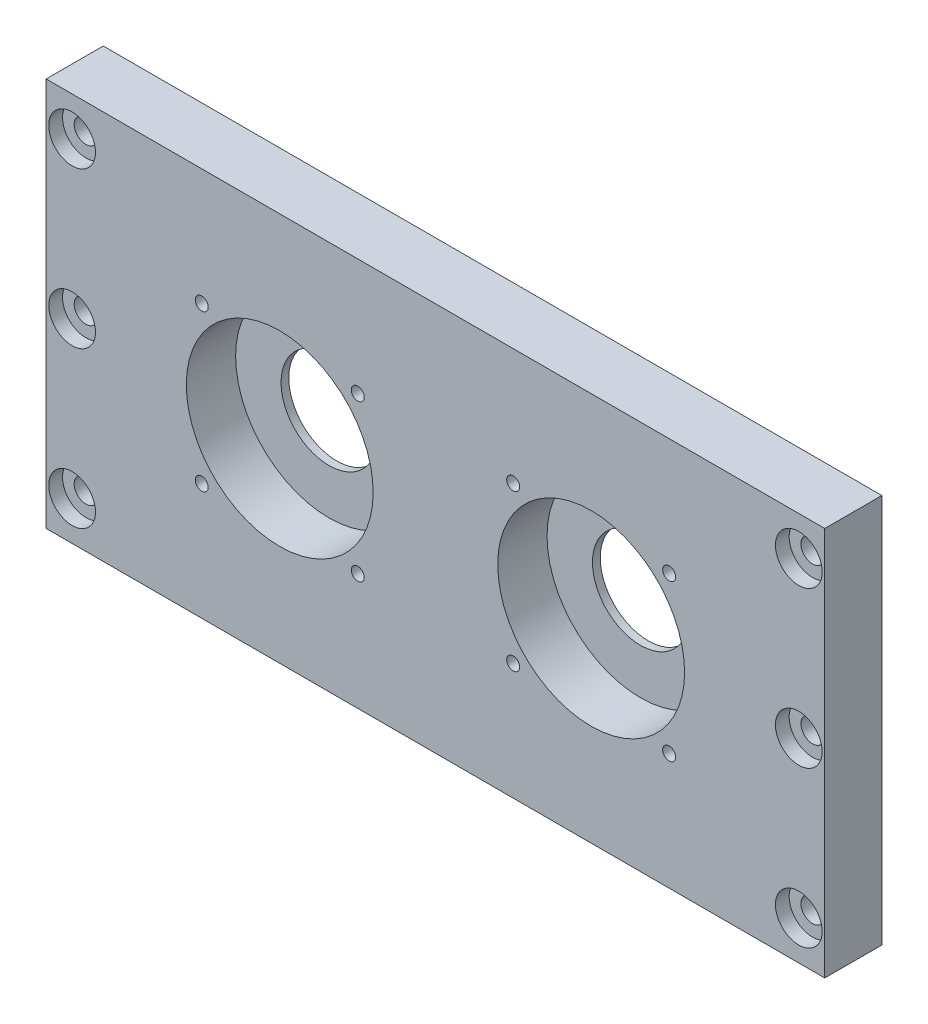
ISO-10303-21;
HEADER;
FILE_DESCRIPTION(('STEP AP214'),'2;1');
FILE_NAME('part.step','',(''),(''),'','','');
FILE_SCHEMA(('AUTOMOTIVE_DESIGN { 1 0 10303 214 1 1 1 1 }'));
ENDSEC;
DATA;
#1=APPLICATION_CONTEXT('core data for automotive mechanical design processes');
#2=APPLICATION_PROTOCOL_DEFINITION('international standard','automotive_design',2000,#1);
#3=PRODUCT_CONTEXT('',#1,'mechanical');
#4=PRODUCT('Part','Part','',(#3));
#5=PRODUCT_RELATED_PRODUCT_CATEGORY('part','',(#4));
#6=PRODUCT_DEFINITION_FORMATION('','',#4);
#7=PRODUCT_DEFINITION_CONTEXT('part definition',#1,'design');
#8=PRODUCT_DEFINITION('design','',#6,#7);
#9=PRODUCT_DEFINITION_SHAPE('','',#8);
#10=(LENGTH_UNIT() NAMED_UNIT(*) SI_UNIT(.MILLI.,.METRE.));
#11=(NAMED_UNIT(*) PLANE_ANGLE_UNIT() SI_UNIT($,.RADIAN.));
#12=(NAMED_UNIT(*) SI_UNIT($,.STERADIAN.) SOLID_ANGLE_UNIT());
#13=UNCERTAINTY_MEASURE_WITH_UNIT(LENGTH_MEASURE(1.E-05),#10,'distance_accuracy_value','');
#14=(GEOMETRIC_REPRESENTATION_CONTEXT(3) GLOBAL_UNCERTAINTY_ASSIGNED_CONTEXT((#13)) GLOBAL_UNIT_ASSIGNED_CONTEXT((#10,
#11,#12)) REPRESENTATION_CONTEXT('',''));
#15=CARTESIAN_POINT('',(0.,0.,0.));
#16=DIRECTION('',(0.,0.,1.));
#17=DIRECTION('',(1.,0.,0.));
#18=AXIS2_PLACEMENT_3D('',#15,#16,#17);
#19=CARTESIAN_POINT('',(0.,0.,0.));
#20=DIRECTION('',(0.,0.,-1.));
#21=DIRECTION('',(-1.,0.,0.));
#22=AXIS2_PLACEMENT_3D('',#19,#20,#21);
#23=PLANE('',#22);
#24=CARTESIAN_POINT('',(29.9479617995716,30.0520382004281,0.));
#25=DIRECTION('',(0.,0.,1.));
#26=DIRECTION('',(1.,0.,0.));
#27=AXIS2_PLACEMENT_3D('',#24,#25,#26);
#28=CIRCLE('',#27,2.5);
#29=CARTESIAN_POINT('',(32.4479617995716,30.0520382004281,0.));
#30=VERTEX_POINT('',#29);
#31=EDGE_CURVE('E230',#30,#30,#28,.T.);
#32=ORIENTED_EDGE('',*,*,#31,.T.);
#33=EDGE_LOOP('',(#32));
#34=FACE_BOUND('',#33,.T.);
#35=CARTESIAN_POINT('',(-90.0520382004278,30.0520382004287,0.));
#36=DIRECTION('',(0.,0.,1.));
#37=DIRECTION('',(1.,0.,0.));
#38=AXIS2_PLACEMENT_3D('',#35,#36,#37);
#39=CIRCLE('',#38,2.5);
#40=CARTESIAN_POINT('',(-87.5520382004278,30.0520382004287,0.));
#41=VERTEX_POINT('',#40);
#42=EDGE_CURVE('E224',#41,#41,#39,.T.);
#43=ORIENTED_EDGE('',*,*,#42,.T.);
#44=EDGE_LOOP('',(#43));
#45=FACE_BOUND('',#44,.T.);
#46=CARTESIAN_POINT('',(-90.0520382004284,-30.0520382004281,0.));
#47=DIRECTION('',(0.,0.,1.));
#48=DIRECTION('',(1.,0.,0.));
#49=AXIS2_PLACEMENT_3D('',#46,#47,#48);
#50=CIRCLE('',#49,2.5);
#51=CARTESIAN_POINT('',(-87.5520382004284,-30.0520382004281,0.));
#52=VERTEX_POINT('',#51);
#53=EDGE_CURVE('E218',#52,#52,#50,.T.);
#54=ORIENTED_EDGE('',*,*,#53,.T.);
#55=EDGE_LOOP('',(#54));
#56=FACE_BOUND('',#55,.T.);
#57=CARTESIAN_POINT('',(-29.947961799572,-30.0520382004285,0.));
#58=DIRECTION('',(0.,0.,1.));
#59=DIRECTION('',(1.,0.,0.));
#60=AXIS2_PLACEMENT_3D('',#57,#58,#59);
#61=CIRCLE('',#60,2.5);
#62=CARTESIAN_POINT('',(-27.447961799572,-30.0520382004285,0.));
#63=VERTEX_POINT('',#62);
#64=EDGE_CURVE('E212',#63,#63,#61,.T.);
#65=ORIENTED_EDGE('',*,*,#64,.T.);
#66=EDGE_LOOP('',(#65));
#67=FACE_BOUND('',#66,.T.);
#68=CARTESIAN_POINT('',(-29.9479617995716,30.0520382004281,0.));
#69=DIRECTION('',(0.,0.,1.));
#70=DIRECTION('',(1.,0.,0.));
#71=AXIS2_PLACEMENT_3D('',#68,#69,#70);
#72=CIRCLE('',#71,2.5);
#73=CARTESIAN_POINT('',(-27.4479617995716,30.0520382004281,0.));
#74=VERTEX_POINT('',#73);
#75=EDGE_CURVE('E206',#74,#74,#72,.T.);
#76=ORIENTED_EDGE('',*,*,#75,.T.);
#77=EDGE_LOOP('',(#76));
#78=FACE_BOUND('',#77,.T.);
#79=CARTESIAN_POINT('',(-140.,-60.,0.));
#80=DIRECTION('',(0.,0.,1.));
#81=DIRECTION('',(1.,0.,0.));
#82=AXIS2_PLACEMENT_3D('',#79,#80,#81);
#83=CIRCLE('',#82,4.5);
#84=CARTESIAN_POINT('',(-135.5,-60.,0.));
#85=VERTEX_POINT('',#84);
#86=EDGE_CURVE('E122',#85,#85,#83,.T.);
#87=ORIENTED_EDGE('',*,*,#86,.T.);
#88=EDGE_LOOP('',(#87));
#89=FACE_BOUND('',#88,.T.);
#90=CARTESIAN_POINT('',(-60.,0.,0.));
#91=DIRECTION('',(0.,0.,-1.));
#92=DIRECTION('',(-1.,0.,0.));
#93=AXIS2_PLACEMENT_3D('',#90,#91,#92);
#94=CIRCLE('',#93,18.5);
#95=CARTESIAN_POINT('',(-78.5,0.,0.));
#96=VERTEX_POINT('',#95);
#97=EDGE_CURVE('E114',#96,#96,#94,.T.);
#98=ORIENTED_EDGE('',*,*,#97,.F.);
#99=EDGE_LOOP('',(#98));
#100=FACE_BOUND('',#99,.T.);
#101=DIRECTION('',(0.,1.,0.));
#102=VECTOR('',#101,1.);
#103=CARTESIAN_POINT('',(150.,-75.,0.));
#104=LINE('',#103,#102);
#105=CARTESIAN_POINT('',(150.,-75.,0.));
#106=VERTEX_POINT('',#105);
#107=CARTESIAN_POINT('',(150.,75.,0.));
#108=VERTEX_POINT('',#107);
#109=EDGE_CURVE('E97',#106,#108,#104,.T.);
#110=ORIENTED_EDGE('',*,*,#109,.F.);
#111=DIRECTION('',(1.,0.,0.));
#112=VECTOR('',#111,1.);
#113=CARTESIAN_POINT('',(-150.,-75.,0.));
#114=LINE('',#113,#112);
#115=CARTESIAN_POINT('',(-150.,-75.,0.));
#116=VERTEX_POINT('',#115);
#117=EDGE_CURVE('E72',#116,#106,#114,.T.);
#118=ORIENTED_EDGE('',*,*,#117,.F.);
#119=DIRECTION('',(0.,-1.,0.));
#120=VECTOR('',#119,1.);
#121=CARTESIAN_POINT('',(-150.,-75.,0.));
#122=LINE('',#121,#120);
#123=CARTESIAN_POINT('',(-150.,75.,0.));
#124=VERTEX_POINT('',#123);
#125=EDGE_CURVE('E66',#124,#116,#122,.T.);
#126=ORIENTED_EDGE('',*,*,#125,.F.);
#127=DIRECTION('',(-1.,0.,0.));
#128=VECTOR('',#127,1.);
#129=CARTESIAN_POINT('',(-150.,75.,0.));
#130=LINE('',#129,#128);
#131=EDGE_CURVE('E89',#108,#124,#130,.T.);
#132=ORIENTED_EDGE('',*,*,#131,.F.);
#133=EDGE_LOOP('',(#110,#118,#126,#132));
#134=FACE_BOUND('',#133,.T.);
#135=CARTESIAN_POINT('',(-140.,0.,0.));
#136=DIRECTION('',(0.,0.,1.));
#137=DIRECTION('',(1.,0.,0.));
#138=AXIS2_PLACEMENT_3D('',#135,#136,#137);
#139=CIRCLE('',#138,4.5);
#140=CARTESIAN_POINT('',(-135.5,0.,0.));
#141=VERTEX_POINT('',#140);
#142=EDGE_CURVE('E134',#141,#141,#139,.T.);
#143=ORIENTED_EDGE('',*,*,#142,.T.);
#144=EDGE_LOOP('',(#143));
#145=FACE_BOUND('',#144,.T.);
#146=CARTESIAN_POINT('',(-140.,60.,0.));
#147=DIRECTION('',(0.,0.,1.));
#148=DIRECTION('',(1.,0.,0.));
#149=AXIS2_PLACEMENT_3D('',#146,#147,#148);
#150=CIRCLE('',#149,4.5);
#151=CARTESIAN_POINT('',(-135.5,60.,0.));
#152=VERTEX_POINT('',#151);
#153=EDGE_CURVE('E146',#152,#152,#150,.T.);
#154=ORIENTED_EDGE('',*,*,#153,.T.);
#155=EDGE_LOOP('',(#154));
#156=FACE_BOUND('',#155,.T.);
#157=CARTESIAN_POINT('',(60.,0.,0.));
#158=DIRECTION('',(0.,0.,-1.));
#159=DIRECTION('',(-1.,0.,0.));
#160=AXIS2_PLACEMENT_3D('',#157,#158,#159);
#161=CIRCLE('',#160,18.5);
#162=CARTESIAN_POINT('',(41.5,0.,0.));
#163=VERTEX_POINT('',#162);
#164=EDGE_CURVE('E162',#163,#163,#161,.T.);
#165=ORIENTED_EDGE('',*,*,#164,.F.);
#166=EDGE_LOOP('',(#165));
#167=FACE_BOUND('',#166,.T.);
#168=CARTESIAN_POINT('',(140.,-60.,0.));
#169=DIRECTION('',(0.,0.,1.));
#170=DIRECTION('',(1.,0.,0.));
#171=AXIS2_PLACEMENT_3D('',#168,#169,#170);
#172=CIRCLE('',#171,4.5);
#173=CARTESIAN_POINT('',(144.5,-60.,0.));
#174=VERTEX_POINT('',#173);
#175=EDGE_CURVE('E170',#174,#174,#172,.T.);
#176=ORIENTED_EDGE('',*,*,#175,.T.);
#177=EDGE_LOOP('',(#176));
#178=FACE_BOUND('',#177,.T.);
#179=CARTESIAN_POINT('',(140.,0.,0.));
#180=DIRECTION('',(0.,0.,1.));
#181=DIRECTION('',(1.,0.,0.));
#182=AXIS2_PLACEMENT_3D('',#179,#180,#181);
#183=CIRCLE('',#182,4.5);
#184=CARTESIAN_POINT('',(144.5,0.,0.));
#185=VERTEX_POINT('',#184);
#186=EDGE_CURVE('E182',#185,#185,#183,.T.);
#187=ORIENTED_EDGE('',*,*,#186,.T.);
#188=EDGE_LOOP('',(#187));
#189=FACE_BOUND('',#188,.T.);
#190=CARTESIAN_POINT('',(140.,60.,0.));
#191=DIRECTION('',(0.,0.,1.));
#192=DIRECTION('',(1.,0.,0.));
#193=AXIS2_PLACEMENT_3D('',#190,#191,#192);
#194=CIRCLE('',#193,4.5);
#195=CARTESIAN_POINT('',(144.5,60.,0.));
#196=VERTEX_POINT('',#195);
#197=EDGE_CURVE('E194',#196,#196,#194,.T.);
#198=ORIENTED_EDGE('',*,*,#197,.T.);
#199=EDGE_LOOP('',(#198));
#200=FACE_BOUND('',#199,.T.);
#201=CARTESIAN_POINT('',(29.947961799572,-30.0520382004285,0.));
#202=DIRECTION('',(0.,0.,1.));
#203=DIRECTION('',(1.,0.,0.));
#204=AXIS2_PLACEMENT_3D('',#201,#202,#203);
#205=CIRCLE('',#204,2.5);
#206=CARTESIAN_POINT('',(32.447961799572,-30.0520382004285,0.));
#207=VERTEX_POINT('',#206);
#208=EDGE_CURVE('E236',#207,#207,#205,.T.);
#209=ORIENTED_EDGE('',*,*,#208,.T.);
#210=EDGE_LOOP('',(#209));
#211=FACE_BOUND('',#210,.T.);
#212=CARTESIAN_POINT('',(90.0520382004284,-30.0520382004281,0.));
#213=DIRECTION('',(0.,0.,1.));
#214=DIRECTION('',(1.,0.,0.));
#215=AXIS2_PLACEMENT_3D('',#212,#213,#214);
#216=CIRCLE('',#215,2.5);
#217=CARTESIAN_POINT('',(92.5520382004284,-30.0520382004281,0.));
#218=VERTEX_POINT('',#217);
#219=EDGE_CURVE('E242',#218,#218,#216,.T.);
#220=ORIENTED_EDGE('',*,*,#219,.T.);
#221=EDGE_LOOP('',(#220));
#222=FACE_BOUND('',#221,.T.);
#223=CARTESIAN_POINT('',(90.0520382004278,30.0520382004287,0.));
#224=DIRECTION('',(0.,0.,1.));
#225=DIRECTION('',(1.,0.,0.));
#226=AXIS2_PLACEMENT_3D('',#223,#224,#225);
#227=CIRCLE('',#226,2.5);
#228=CARTESIAN_POINT('',(92.5520382004278,30.0520382004287,0.));
#229=VERTEX_POINT('',#228);
#230=EDGE_CURVE('E248',#229,#229,#227,.T.);
#231=ORIENTED_EDGE('',*,*,#230,.T.);
#232=EDGE_LOOP('',(#231));
#233=FACE_BOUND('',#232,.T.);
#234=ADVANCED_FACE('F32',(#34,#45,#56,#67,#78,#89,#100,#134,#145,#156,#167,#178,#189,#200,#211,
#222,#233),#23,.T.);
#235=CARTESIAN_POINT('',(0.,0.,22.));
#236=DIRECTION('',(0.,0.,-1.));
#237=DIRECTION('',(-1.,0.,0.));
#238=AXIS2_PLACEMENT_3D('',#235,#236,#237);
#239=PLANE('',#238);
#240=CARTESIAN_POINT('',(90.0520382004284,-30.0520382004281,22.));
#241=DIRECTION('',(0.,0.,1.));
#242=DIRECTION('',(1.,0.,0.));
#243=AXIS2_PLACEMENT_3D('',#240,#241,#242);
#244=CIRCLE('',#243,2.5);
#245=CARTESIAN_POINT('',(92.5520382004284,-30.0520382004281,22.));
#246=VERTEX_POINT('',#245);
#247=EDGE_CURVE('E245',#246,#246,#244,.T.);
#248=ORIENTED_EDGE('',*,*,#247,.F.);
#249=EDGE_LOOP('',(#248));
#250=FACE_BOUND('',#249,.T.);
#251=CARTESIAN_POINT('',(29.947961799572,-30.0520382004285,22.));
#252=DIRECTION('',(0.,0.,1.));
#253=DIRECTION('',(1.,0.,0.));
#254=AXIS2_PLACEMENT_3D('',#251,#252,#253);
#255=CIRCLE('',#254,2.5);
#256=CARTESIAN_POINT('',(32.447961799572,-30.0520382004285,22.));
#257=VERTEX_POINT('',#256);
#258=EDGE_CURVE('E239',#257,#257,#255,.T.);
#259=ORIENTED_EDGE('',*,*,#258,.F.);
#260=EDGE_LOOP('',(#259));
#261=FACE_BOUND('',#260,.T.);
#262=CARTESIAN_POINT('',(29.9479617995716,30.0520382004281,22.));
#263=DIRECTION('',(0.,0.,1.));
#264=DIRECTION('',(1.,0.,0.));
#265=AXIS2_PLACEMENT_3D('',#262,#263,#264);
#266=CIRCLE('',#265,2.5);
#267=CARTESIAN_POINT('',(32.4479617995716,30.0520382004281,22.));
#268=VERTEX_POINT('',#267);
#269=EDGE_CURVE('E233',#268,#268,#266,.T.);
#270=ORIENTED_EDGE('',*,*,#269,.F.);
#271=EDGE_LOOP('',(#270));
#272=FACE_BOUND('',#271,.T.);
#273=CARTESIAN_POINT('',(-90.0520382004278,30.0520382004287,22.));
#274=DIRECTION('',(0.,0.,1.));
#275=DIRECTION('',(1.,0.,0.));
#276=AXIS2_PLACEMENT_3D('',#273,#274,#275);
#277=CIRCLE('',#276,2.5);
#278=CARTESIAN_POINT('',(-87.5520382004278,30.0520382004287,22.));
#279=VERTEX_POINT('',#278);
#280=EDGE_CURVE('E227',#279,#279,#277,.T.);
#281=ORIENTED_EDGE('',*,*,#280,.F.);
#282=EDGE_LOOP('',(#281));
#283=FACE_BOUND('',#282,.T.);
#284=CARTESIAN_POINT('',(-29.947961799572,-30.0520382004285,22.));
#285=DIRECTION('',(0.,0.,1.));
#286=DIRECTION('',(1.,0.,0.));
#287=AXIS2_PLACEMENT_3D('',#284,#285,#286);
#288=CIRCLE('',#287,2.5);
#289=CARTESIAN_POINT('',(-27.447961799572,-30.0520382004285,22.));
#290=VERTEX_POINT('',#289);
#291=EDGE_CURVE('E215',#290,#290,#288,.T.);
#292=ORIENTED_EDGE('',*,*,#291,.F.);
#293=EDGE_LOOP('',(#292));
#294=FACE_BOUND('',#293,.T.);
#295=CARTESIAN_POINT('',(-29.9479617995716,30.0520382004281,22.));
#296=DIRECTION('',(0.,0.,1.));
#297=DIRECTION('',(1.,0.,0.));
#298=AXIS2_PLACEMENT_3D('',#295,#296,#297);
#299=CIRCLE('',#298,2.5);
#300=CARTESIAN_POINT('',(-27.4479617995716,30.0520382004281,22.));
#301=VERTEX_POINT('',#300);
#302=EDGE_CURVE('E209',#301,#301,#299,.T.);
#303=ORIENTED_EDGE('',*,*,#302,.F.);
#304=EDGE_LOOP('',(#303));
#305=FACE_BOUND('',#304,.T.);
#306=CARTESIAN_POINT('',(140.,60.,22.));
#307=DIRECTION('',(0.,0.,1.));
#308=DIRECTION('',(1.,0.,0.));
#309=AXIS2_PLACEMENT_3D('',#306,#307,#308);
#310=CIRCLE('',#309,9.0055);
#311=CARTESIAN_POINT('',(149.0055,60.,22.));
#312=VERTEX_POINT('',#311);
#313=EDGE_CURVE('E203',#312,#312,#310,.T.);
#314=ORIENTED_EDGE('',*,*,#313,.F.);
#315=EDGE_LOOP('',(#314));
#316=FACE_BOUND('',#315,.T.);
#317=CARTESIAN_POINT('',(140.,0.,22.));
#318=DIRECTION('',(0.,0.,1.));
#319=DIRECTION('',(1.,0.,0.));
#320=AXIS2_PLACEMENT_3D('',#317,#318,#319);
#321=CIRCLE('',#320,9.0055);
#322=CARTESIAN_POINT('',(149.0055,0.,22.));
#323=VERTEX_POINT('',#322);
#324=EDGE_CURVE('E191',#323,#323,#321,.T.);
#325=ORIENTED_EDGE('',*,*,#324,.F.);
#326=EDGE_LOOP('',(#325));
#327=FACE_BOUND('',#326,.T.);
#328=CARTESIAN_POINT('',(140.,-60.,22.));
#329=DIRECTION('',(0.,0.,1.));
#330=DIRECTION('',(1.,0.,0.));
#331=AXIS2_PLACEMENT_3D('',#328,#329,#330);
#332=CIRCLE('',#331,9.0055);
#333=CARTESIAN_POINT('',(149.0055,-60.,22.));
#334=VERTEX_POINT('',#333);
#335=EDGE_CURVE('E179',#334,#334,#332,.T.);
#336=ORIENTED_EDGE('',*,*,#335,.F.);
#337=EDGE_LOOP('',(#336));
#338=FACE_BOUND('',#337,.T.);
#339=CARTESIAN_POINT('',(60.,0.,22.));
#340=DIRECTION('',(0.,0.,-1.));
#341=DIRECTION('',(-1.,0.,0.));
#342=AXIS2_PLACEMENT_3D('',#339,#340,#341);
#343=CIRCLE('',#342,36.);
#344=CARTESIAN_POINT('',(24.,0.,22.));
#345=VERTEX_POINT('',#344);
#346=EDGE_CURVE('E159',#345,#345,#343,.T.);
#347=ORIENTED_EDGE('',*,*,#346,.T.);
#348=EDGE_LOOP('',(#347));
#349=FACE_BOUND('',#348,.T.);
#350=CARTESIAN_POINT('',(-140.,60.,22.));
#351=DIRECTION('',(0.,0.,1.));
#352=DIRECTION('',(1.,0.,0.));
#353=AXIS2_PLACEMENT_3D('',#350,#351,#352);
#354=CIRCLE('',#353,9.0055);
#355=CARTESIAN_POINT('',(-130.9945,60.,22.));
#356=VERTEX_POINT('',#355);
#357=EDGE_CURVE('E155',#356,#356,#354,.T.);
#358=ORIENTED_EDGE('',*,*,#357,.F.);
#359=EDGE_LOOP('',(#358));
#360=FACE_BOUND('',#359,.T.);
#361=CARTESIAN_POINT('',(-140.,0.,22.));
#362=DIRECTION('',(0.,0.,1.));
#363=DIRECTION('',(1.,0.,0.));
#364=AXIS2_PLACEMENT_3D('',#361,#362,#363);
#365=CIRCLE('',#364,9.0055);
#366=CARTESIAN_POINT('',(-130.9945,0.,22.));
#367=VERTEX_POINT('',#366);
#368=EDGE_CURVE('E143',#367,#367,#365,.T.);
#369=ORIENTED_EDGE('',*,*,#368,.F.);
#370=EDGE_LOOP('',(#369));
#371=FACE_BOUND('',#370,.T.);
#372=CARTESIAN_POINT('',(-60.,0.,22.));
#373=DIRECTION('',(0.,0.,-1.));
#374=DIRECTION('',(-1.,0.,0.));
#375=AXIS2_PLACEMENT_3D('',#372,#373,#374);
#376=CIRCLE('',#375,36.);
#377=CARTESIAN_POINT('',(-96.,0.,22.));
#378=VERTEX_POINT('',#377);
#379=EDGE_CURVE('E111',#378,#378,#376,.T.);
#380=ORIENTED_EDGE('',*,*,#379,.T.);
#381=EDGE_LOOP('',(#380));
#382=FACE_BOUND('',#381,.T.);
#383=DIRECTION('',(0.,1.,0.));
#384=VECTOR('',#383,1.);
#385=CARTESIAN_POINT('',(150.,-75.,22.));
#386=LINE('',#385,#384);
#387=CARTESIAN_POINT('',(150.,-75.,22.));
#388=VERTEX_POINT('',#387);
#389=CARTESIAN_POINT('',(150.,75.,22.));
#390=VERTEX_POINT('',#389);
#391=EDGE_CURVE('E85',#388,#390,#386,.T.);
#392=ORIENTED_EDGE('',*,*,#391,.T.);
#393=DIRECTION('',(-1.,0.,0.));
#394=VECTOR('',#393,1.);
#395=CARTESIAN_POINT('',(-150.,75.,22.));
#396=LINE('',#395,#394);
#397=CARTESIAN_POINT('',(-150.,75.,22.));
#398=VERTEX_POINT('',#397);
#399=EDGE_CURVE('E79',#390,#398,#396,.T.);
#400=ORIENTED_EDGE('',*,*,#399,.T.);
#401=DIRECTION('',(0.,-1.,0.));
#402=VECTOR('',#401,1.);
#403=CARTESIAN_POINT('',(-150.,-75.,22.));
#404=LINE('',#403,#402);
#405=CARTESIAN_POINT('',(-150.,-75.,22.));
#406=VERTEX_POINT('',#405);
#407=EDGE_CURVE('E83',#398,#406,#404,.T.);
#408=ORIENTED_EDGE('',*,*,#407,.T.);
#409=DIRECTION('',(1.,0.,0.));
#410=VECTOR('',#409,1.);
#411=CARTESIAN_POINT('',(-150.,-75.,22.));
#412=LINE('',#411,#410);
#413=EDGE_CURVE('E49',#406,#388,#412,.T.);
#414=ORIENTED_EDGE('',*,*,#413,.T.);
#415=EDGE_LOOP('',(#392,#400,#408,#414));
#416=FACE_BOUND('',#415,.T.);
#417=CARTESIAN_POINT('',(-140.,-60.,22.));
#418=DIRECTION('',(0.,0.,1.));
#419=DIRECTION('',(1.,0.,0.));
#420=AXIS2_PLACEMENT_3D('',#417,#418,#419);
#421=CIRCLE('',#420,9.0055);
#422=CARTESIAN_POINT('',(-130.9945,-60.,22.));
#423=VERTEX_POINT('',#422);
#424=EDGE_CURVE('E131',#423,#423,#421,.T.);
#425=ORIENTED_EDGE('',*,*,#424,.F.);
#426=EDGE_LOOP('',(#425));
#427=FACE_BOUND('',#426,.T.);
#428=CARTESIAN_POINT('',(-90.0520382004284,-30.0520382004281,22.));
#429=DIRECTION('',(0.,0.,1.));
#430=DIRECTION('',(1.,0.,0.));
#431=AXIS2_PLACEMENT_3D('',#428,#429,#430);
#432=CIRCLE('',#431,2.5);
#433=CARTESIAN_POINT('',(-87.5520382004284,-30.0520382004281,22.));
#434=VERTEX_POINT('',#433);
#435=EDGE_CURVE('E221',#434,#434,#432,.T.);
#436=ORIENTED_EDGE('',*,*,#435,.F.);
#437=EDGE_LOOP('',(#436));
#438=FACE_BOUND('',#437,.T.);
#439=CARTESIAN_POINT('',(90.0520382004278,30.0520382004287,22.));
#440=DIRECTION('',(0.,0.,1.));
#441=DIRECTION('',(1.,0.,0.));
#442=AXIS2_PLACEMENT_3D('',#439,#440,#441);
#443=CIRCLE('',#442,2.5);
#444=CARTESIAN_POINT('',(92.5520382004278,30.0520382004287,22.));
#445=VERTEX_POINT('',#444);
#446=EDGE_CURVE('E251',#445,#445,#443,.T.);
#447=ORIENTED_EDGE('',*,*,#446,.F.);
#448=EDGE_LOOP('',(#447));
#449=FACE_BOUND('',#448,.T.);
#450=ADVANCED_FACE('F80',(#250,#261,#272,#283,#294,#305,#316,#327,#338,#349,#360,#371,#382,#416,
#427,#438,#449),#239,.F.);
#451=CARTESIAN_POINT('',(150.,-75.,22.));
#452=DIRECTION('',(-1.,0.,0.));
#453=DIRECTION('',(0.,0.,1.));
#454=AXIS2_PLACEMENT_3D('',#451,#452,#453);
#455=PLANE('',#454);
#456=ORIENTED_EDGE('',*,*,#109,.T.);
#457=DIRECTION('',(0.,0.,-1.));
#458=VECTOR('',#457,1.);
#459=CARTESIAN_POINT('',(150.,75.,22.));
#460=LINE('',#459,#458);
#461=EDGE_CURVE('E11',#390,#108,#460,.T.);
#462=ORIENTED_EDGE('',*,*,#461,.F.);
#463=ORIENTED_EDGE('',*,*,#391,.F.);
#464=DIRECTION('',(0.,0.,-1.));
#465=VECTOR('',#464,1.);
#466=CARTESIAN_POINT('',(150.,-75.,22.));
#467=LINE('',#466,#465);
#468=EDGE_CURVE('E93',#388,#106,#467,.T.);
#469=ORIENTED_EDGE('',*,*,#468,.T.);
#470=EDGE_LOOP('',(#456,#462,#463,#469));
#471=FACE_BOUND('',#470,.T.);
#472=ADVANCED_FACE('F34',(#471),#455,.F.);
#473=CARTESIAN_POINT('',(-150.,75.,22.));
#474=DIRECTION('',(0.,-1.,0.));
#475=DIRECTION('',(0.,0.,-1.));
#476=AXIS2_PLACEMENT_3D('',#473,#474,#475);
#477=PLANE('',#476);
#478=ORIENTED_EDGE('',*,*,#131,.T.);
#479=DIRECTION('',(0.,0.,-1.));
#480=VECTOR('',#479,1.);
#481=CARTESIAN_POINT('',(-150.,75.,22.));
#482=LINE('',#481,#480);
#483=EDGE_CURVE('E41',#398,#124,#482,.T.);
#484=ORIENTED_EDGE('',*,*,#483,.F.);
#485=ORIENTED_EDGE('',*,*,#399,.F.);
#486=ORIENTED_EDGE('',*,*,#461,.T.);
#487=EDGE_LOOP('',(#478,#484,#485,#486));
#488=FACE_BOUND('',#487,.T.);
#489=ADVANCED_FACE('F88',(#488),#477,.F.);
#490=CARTESIAN_POINT('',(-150.,-75.,22.));
#491=DIRECTION('',(1.,0.,0.));
#492=DIRECTION('',(0.,0.,-1.));
#493=AXIS2_PLACEMENT_3D('',#490,#491,#492);
#494=PLANE('',#493);
#495=ORIENTED_EDGE('',*,*,#125,.T.);
#496=DIRECTION('',(0.,0.,-1.));
#497=VECTOR('',#496,1.);
#498=CARTESIAN_POINT('',(-150.,-75.,22.));
#499=LINE('',#498,#497);
#500=EDGE_CURVE('E90',#406,#116,#499,.T.);
#501=ORIENTED_EDGE('',*,*,#500,.F.);
#502=ORIENTED_EDGE('',*,*,#407,.F.);
#503=ORIENTED_EDGE('',*,*,#483,.T.);
#504=EDGE_LOOP('',(#495,#501,#502,#503));
#505=FACE_BOUND('',#504,.T.);
#506=ADVANCED_FACE('F91',(#505),#494,.F.);
#507=CARTESIAN_POINT('',(-150.,-75.,22.));
#508=DIRECTION('',(0.,1.,0.));
#509=DIRECTION('',(0.,0.,1.));
#510=AXIS2_PLACEMENT_3D('',#507,#508,#509);
#511=PLANE('',#510);
#512=ORIENTED_EDGE('',*,*,#117,.T.);
#513=ORIENTED_EDGE('',*,*,#468,.F.);
#514=ORIENTED_EDGE('',*,*,#413,.F.);
#515=ORIENTED_EDGE('',*,*,#500,.T.);
#516=EDGE_LOOP('',(#512,#513,#514,#515));
#517=FACE_BOUND('',#516,.T.);
#518=ADVANCED_FACE('F105',(#517),#511,.F.);
#519=CARTESIAN_POINT('',(-60.,0.,3.));
#520=DIRECTION('',(0.,0.,1.));
#521=DIRECTION('',(1.,0.,0.));
#522=AXIS2_PLACEMENT_3D('',#519,#520,#521);
#523=CYLINDRICAL_SURFACE('',#522,36.);
#524=CARTESIAN_POINT('',(-60.,0.,3.));
#525=DIRECTION('',(0.,0.,-1.));
#526=DIRECTION('',(-1.,0.,0.));
#527=AXIS2_PLACEMENT_3D('',#524,#525,#526);
#528=CIRCLE('',#527,36.);
#529=CARTESIAN_POINT('',(-96.,0.,3.));
#530=VERTEX_POINT('',#529);
#531=EDGE_CURVE('E100',#530,#530,#528,.T.);
#532=ORIENTED_EDGE('',*,*,#531,.T.);
#533=EDGE_LOOP('',(#532));
#534=FACE_BOUND('',#533,.T.);
#535=ORIENTED_EDGE('',*,*,#379,.F.);
#536=EDGE_LOOP('',(#535));
#537=FACE_BOUND('',#536,.T.);
#538=ADVANCED_FACE('F269',(#534,#537),#523,.F.);
#539=CARTESIAN_POINT('',(-60.,0.,3.));
#540=DIRECTION('',(0.,0.,-1.));
#541=DIRECTION('',(-1.,0.,0.));
#542=AXIS2_PLACEMENT_3D('',#539,#540,#541);
#543=PLANE('',#542);
#544=CARTESIAN_POINT('',(-60.,0.,3.));
#545=DIRECTION('',(0.,0.,-1.));
#546=DIRECTION('',(-1.,0.,0.));
#547=AXIS2_PLACEMENT_3D('',#544,#545,#546);
#548=CIRCLE('',#547,18.5);
#549=CARTESIAN_POINT('',(-78.5,0.,3.));
#550=VERTEX_POINT('',#549);
#551=EDGE_CURVE('E119',#550,#550,#548,.T.);
#552=ORIENTED_EDGE('',*,*,#551,.T.);
#553=EDGE_LOOP('',(#552));
#554=FACE_BOUND('',#553,.T.);
#555=ORIENTED_EDGE('',*,*,#531,.F.);
#556=EDGE_LOOP('',(#555));
#557=FACE_BOUND('',#556,.T.);
#558=ADVANCED_FACE('F294',(#554,#557),#543,.F.);
#559=CARTESIAN_POINT('',(-60.,0.,-0.00100000000000013));
#560=DIRECTION('',(0.,0.,1.));
#561=DIRECTION('',(1.,0.,0.));
#562=AXIS2_PLACEMENT_3D('',#559,#560,#561);
#563=CYLINDRICAL_SURFACE('',#562,18.5);
#564=ORIENTED_EDGE('',*,*,#97,.T.);
#565=EDGE_LOOP('',(#564));
#566=FACE_BOUND('',#565,.T.);
#567=ORIENTED_EDGE('',*,*,#551,.F.);
#568=EDGE_LOOP('',(#567));
#569=FACE_BOUND('',#568,.T.);
#570=ADVANCED_FACE('F301',(#566,#569),#563,.F.);
#571=CARTESIAN_POINT('',(-140.,-60.,22.));
#572=DIRECTION('',(0.,0.,1.));
#573=DIRECTION('',(1.,0.,0.));
#574=AXIS2_PLACEMENT_3D('',#571,#572,#573);
#575=CYLINDRICAL_SURFACE('',#574,4.5);
#576=ORIENTED_EDGE('',*,*,#86,.F.);
#577=EDGE_LOOP('',(#576));
#578=FACE_BOUND('',#577,.T.);
#579=CARTESIAN_POINT('',(-140.,-60.,16.7));
#580=DIRECTION('',(0.,0.,1.));
#581=DIRECTION('',(1.,0.,0.));
#582=AXIS2_PLACEMENT_3D('',#579,#580,#581);
#583=CIRCLE('',#582,4.5);
#584=CARTESIAN_POINT('',(-135.5,-60.,16.7));
#585=VERTEX_POINT('',#584);
#586=EDGE_CURVE('E125',#585,#585,#583,.T.);
#587=ORIENTED_EDGE('',*,*,#586,.T.);
#588=EDGE_LOOP('',(#587));
#589=FACE_BOUND('',#588,.T.);
#590=ADVANCED_FACE('F308',(#578,#589),#575,.F.);
#591=CARTESIAN_POINT('',(-135.5,-60.,16.7));
#592=DIRECTION('',(0.,0.,-1.));
#593=DIRECTION('',(-1.,0.,0.));
#594=AXIS2_PLACEMENT_3D('',#591,#592,#593);
#595=PLANE('',#594);
#596=ORIENTED_EDGE('',*,*,#586,.F.);
#597=EDGE_LOOP('',(#596));
#598=FACE_BOUND('',#597,.T.);
#599=CARTESIAN_POINT('',(-140.,-60.,16.7));
#600=DIRECTION('',(0.,0.,1.));
#601=DIRECTION('',(1.,0.,0.));
#602=AXIS2_PLACEMENT_3D('',#599,#600,#601);
#603=CIRCLE('',#602,9.0055);
#604=CARTESIAN_POINT('',(-130.9945,-60.,16.7));
#605=VERTEX_POINT('',#604);
#606=EDGE_CURVE('E128',#605,#605,#603,.T.);
#607=ORIENTED_EDGE('',*,*,#606,.T.);
#608=EDGE_LOOP('',(#607));
#609=FACE_BOUND('',#608,.T.);
#610=ADVANCED_FACE('F316',(#598,#609),#595,.F.);
#611=CARTESIAN_POINT('',(-140.,-60.,22.));
#612=DIRECTION('',(0.,0.,1.));
#613=DIRECTION('',(1.,0.,0.));
#614=AXIS2_PLACEMENT_3D('',#611,#612,#613);
#615=CYLINDRICAL_SURFACE('',#614,9.0055);
#616=ORIENTED_EDGE('',*,*,#606,.F.);
#617=EDGE_LOOP('',(#616));
#618=FACE_BOUND('',#617,.T.);
#619=ORIENTED_EDGE('',*,*,#424,.T.);
#620=EDGE_LOOP('',(#619));
#621=FACE_BOUND('',#620,.T.);
#622=ADVANCED_FACE('F324',(#618,#621),#615,.F.);
#623=CARTESIAN_POINT('',(-140.,0.,22.));
#624=DIRECTION('',(0.,0.,1.));
#625=DIRECTION('',(1.,0.,0.));
#626=AXIS2_PLACEMENT_3D('',#623,#624,#625);
#627=CYLINDRICAL_SURFACE('',#626,4.5);
#628=ORIENTED_EDGE('',*,*,#142,.F.);
#629=EDGE_LOOP('',(#628));
#630=FACE_BOUND('',#629,.T.);
#631=CARTESIAN_POINT('',(-140.,0.,16.7));
#632=DIRECTION('',(0.,0.,1.));
#633=DIRECTION('',(1.,0.,0.));
#634=AXIS2_PLACEMENT_3D('',#631,#632,#633);
#635=CIRCLE('',#634,4.5);
#636=CARTESIAN_POINT('',(-135.5,0.,16.7));
#637=VERTEX_POINT('',#636);
#638=EDGE_CURVE('E137',#637,#637,#635,.T.);
#639=ORIENTED_EDGE('',*,*,#638,.T.);
#640=EDGE_LOOP('',(#639));
#641=FACE_BOUND('',#640,.T.);
#642=ADVANCED_FACE('F332',(#630,#641),#627,.F.);
#643=CARTESIAN_POINT('',(-135.5,0.,16.7));
#644=DIRECTION('',(0.,0.,-1.));
#645=DIRECTION('',(-1.,0.,0.));
#646=AXIS2_PLACEMENT_3D('',#643,#644,#645);
#647=PLANE('',#646);
#648=ORIENTED_EDGE('',*,*,#638,.F.);
#649=EDGE_LOOP('',(#648));
#650=FACE_BOUND('',#649,.T.);
#651=CARTESIAN_POINT('',(-140.,0.,16.7));
#652=DIRECTION('',(0.,0.,1.));
#653=DIRECTION('',(1.,0.,0.));
#654=AXIS2_PLACEMENT_3D('',#651,#652,#653);
#655=CIRCLE('',#654,9.0055);
#656=CARTESIAN_POINT('',(-130.9945,0.,16.7));
#657=VERTEX_POINT('',#656);
#658=EDGE_CURVE('E140',#657,#657,#655,.T.);
#659=ORIENTED_EDGE('',*,*,#658,.T.);
#660=EDGE_LOOP('',(#659));
#661=FACE_BOUND('',#660,.T.);
#662=ADVANCED_FACE('F340',(#650,#661),#647,.F.);
#663=CARTESIAN_POINT('',(-140.,0.,22.));
#664=DIRECTION('',(0.,0.,1.));
#665=DIRECTION('',(1.,0.,0.));
#666=AXIS2_PLACEMENT_3D('',#663,#664,#665);
#667=CYLINDRICAL_SURFACE('',#666,9.0055);
#668=ORIENTED_EDGE('',*,*,#658,.F.);
#669=EDGE_LOOP('',(#668));
#670=FACE_BOUND('',#669,.T.);
#671=ORIENTED_EDGE('',*,*,#368,.T.);
#672=EDGE_LOOP('',(#671));
#673=FACE_BOUND('',#672,.T.);
#674=ADVANCED_FACE('F348',(#670,#673),#667,.F.);
#675=CARTESIAN_POINT('',(-140.,60.,22.));
#676=DIRECTION('',(0.,0.,1.));
#677=DIRECTION('',(1.,0.,0.));
#678=AXIS2_PLACEMENT_3D('',#675,#676,#677);
#679=CYLINDRICAL_SURFACE('',#678,4.5);
#680=ORIENTED_EDGE('',*,*,#153,.F.);
#681=EDGE_LOOP('',(#680));
#682=FACE_BOUND('',#681,.T.);
#683=CARTESIAN_POINT('',(-140.,60.,16.7));
#684=DIRECTION('',(0.,0.,1.));
#685=DIRECTION('',(1.,0.,0.));
#686=AXIS2_PLACEMENT_3D('',#683,#684,#685);
#687=CIRCLE('',#686,4.5);
#688=CARTESIAN_POINT('',(-135.5,60.,16.7));
#689=VERTEX_POINT('',#688);
#690=EDGE_CURVE('E149',#689,#689,#687,.T.);
#691=ORIENTED_EDGE('',*,*,#690,.T.);
#692=EDGE_LOOP('',(#691));
#693=FACE_BOUND('',#692,.T.);
#694=ADVANCED_FACE('F356',(#682,#693),#679,.F.);
#695=CARTESIAN_POINT('',(-135.5,60.,16.7));
#696=DIRECTION('',(0.,0.,-1.));
#697=DIRECTION('',(-1.,0.,0.));
#698=AXIS2_PLACEMENT_3D('',#695,#696,#697);
#699=PLANE('',#698);
#700=ORIENTED_EDGE('',*,*,#690,.F.);
#701=EDGE_LOOP('',(#700));
#702=FACE_BOUND('',#701,.T.);
#703=CARTESIAN_POINT('',(-140.,60.,16.7));
#704=DIRECTION('',(0.,0.,1.));
#705=DIRECTION('',(1.,0.,0.));
#706=AXIS2_PLACEMENT_3D('',#703,#704,#705);
#707=CIRCLE('',#706,9.0055);
#708=CARTESIAN_POINT('',(-130.9945,60.,16.7));
#709=VERTEX_POINT('',#708);
#710=EDGE_CURVE('E152',#709,#709,#707,.T.);
#711=ORIENTED_EDGE('',*,*,#710,.T.);
#712=EDGE_LOOP('',(#711));
#713=FACE_BOUND('',#712,.T.);
#714=ADVANCED_FACE('F364',(#702,#713),#699,.F.);
#715=CARTESIAN_POINT('',(-140.,60.,22.));
#716=DIRECTION('',(0.,0.,1.));
#717=DIRECTION('',(1.,0.,0.));
#718=AXIS2_PLACEMENT_3D('',#715,#716,#717);
#719=CYLINDRICAL_SURFACE('',#718,9.0055);
#720=ORIENTED_EDGE('',*,*,#710,.F.);
#721=EDGE_LOOP('',(#720));
#722=FACE_BOUND('',#721,.T.);
#723=ORIENTED_EDGE('',*,*,#357,.T.);
#724=EDGE_LOOP('',(#723));
#725=FACE_BOUND('',#724,.T.);
#726=ADVANCED_FACE('F372',(#722,#725),#719,.F.);
#727=CARTESIAN_POINT('',(60.,0.,3.));
#728=DIRECTION('',(0.,0.,1.));
#729=DIRECTION('',(1.,0.,0.));
#730=AXIS2_PLACEMENT_3D('',#727,#728,#729);
#731=CYLINDRICAL_SURFACE('',#730,36.);
#732=CARTESIAN_POINT('',(60.,0.,3.));
#733=DIRECTION('',(0.,0.,-1.));
#734=DIRECTION('',(-1.,0.,0.));
#735=AXIS2_PLACEMENT_3D('',#732,#733,#734);
#736=CIRCLE('',#735,36.);
#737=CARTESIAN_POINT('',(24.,0.,3.));
#738=VERTEX_POINT('',#737);
#739=EDGE_CURVE('E158',#738,#738,#736,.T.);
#740=ORIENTED_EDGE('',*,*,#739,.T.);
#741=EDGE_LOOP('',(#740));
#742=FACE_BOUND('',#741,.T.);
#743=ORIENTED_EDGE('',*,*,#346,.F.);
#744=EDGE_LOOP('',(#743));
#745=FACE_BOUND('',#744,.T.);
#746=ADVANCED_FACE('F380',(#742,#745),#731,.F.);
#747=CARTESIAN_POINT('',(60.,0.,3.));
#748=DIRECTION('',(0.,0.,-1.));
#749=DIRECTION('',(-1.,0.,0.));
#750=AXIS2_PLACEMENT_3D('',#747,#748,#749);
#751=PLANE('',#750);
#752=CARTESIAN_POINT('',(60.,0.,3.));
#753=DIRECTION('',(0.,0.,-1.));
#754=DIRECTION('',(-1.,0.,0.));
#755=AXIS2_PLACEMENT_3D('',#752,#753,#754);
#756=CIRCLE('',#755,18.5);
#757=CARTESIAN_POINT('',(41.5,0.,3.));
#758=VERTEX_POINT('',#757);
#759=EDGE_CURVE('E167',#758,#758,#756,.T.);
#760=ORIENTED_EDGE('',*,*,#759,.T.);
#761=EDGE_LOOP('',(#760));
#762=FACE_BOUND('',#761,.T.);
#763=ORIENTED_EDGE('',*,*,#739,.F.);
#764=EDGE_LOOP('',(#763));
#765=FACE_BOUND('',#764,.T.);
#766=ADVANCED_FACE('F388',(#762,#765),#751,.F.);
#767=CARTESIAN_POINT('',(60.,0.,-0.00100000000000013));
#768=DIRECTION('',(0.,0.,1.));
#769=DIRECTION('',(1.,0.,0.));
#770=AXIS2_PLACEMENT_3D('',#767,#768,#769);
#771=CYLINDRICAL_SURFACE('',#770,18.5);
#772=ORIENTED_EDGE('',*,*,#164,.T.);
#773=EDGE_LOOP('',(#772));
#774=FACE_BOUND('',#773,.T.);
#775=ORIENTED_EDGE('',*,*,#759,.F.);
#776=EDGE_LOOP('',(#775));
#777=FACE_BOUND('',#776,.T.);
#778=ADVANCED_FACE('F396',(#774,#777),#771,.F.);
#779=CARTESIAN_POINT('',(140.,-60.,22.));
#780=DIRECTION('',(0.,0.,1.));
#781=DIRECTION('',(1.,0.,0.));
#782=AXIS2_PLACEMENT_3D('',#779,#780,#781);
#783=CYLINDRICAL_SURFACE('',#782,4.5);
#784=ORIENTED_EDGE('',*,*,#175,.F.);
#785=EDGE_LOOP('',(#784));
#786=FACE_BOUND('',#785,.T.);
#787=CARTESIAN_POINT('',(140.,-60.,16.7));
#788=DIRECTION('',(0.,0.,1.));
#789=DIRECTION('',(1.,0.,0.));
#790=AXIS2_PLACEMENT_3D('',#787,#788,#789);
#791=CIRCLE('',#790,4.5);
#792=CARTESIAN_POINT('',(144.5,-60.,16.7));
#793=VERTEX_POINT('',#792);
#794=EDGE_CURVE('E173',#793,#793,#791,.T.);
#795=ORIENTED_EDGE('',*,*,#794,.T.);
#796=EDGE_LOOP('',(#795));
#797=FACE_BOUND('',#796,.T.);
#798=ADVANCED_FACE('F404',(#786,#797),#783,.F.);
#799=CARTESIAN_POINT('',(144.5,-60.,16.7));
#800=DIRECTION('',(0.,0.,-1.));
#801=DIRECTION('',(-1.,0.,0.));
#802=AXIS2_PLACEMENT_3D('',#799,#800,#801);
#803=PLANE('',#802);
#804=ORIENTED_EDGE('',*,*,#794,.F.);
#805=EDGE_LOOP('',(#804));
#806=FACE_BOUND('',#805,.T.);
#807=CARTESIAN_POINT('',(140.,-60.,16.7));
#808=DIRECTION('',(0.,0.,1.));
#809=DIRECTION('',(1.,0.,0.));
#810=AXIS2_PLACEMENT_3D('',#807,#808,#809);
#811=CIRCLE('',#810,9.0055);
#812=CARTESIAN_POINT('',(149.0055,-60.,16.7));
#813=VERTEX_POINT('',#812);
#814=EDGE_CURVE('E176',#813,#813,#811,.T.);
#815=ORIENTED_EDGE('',*,*,#814,.T.);
#816=EDGE_LOOP('',(#815));
#817=FACE_BOUND('',#816,.T.);
#818=ADVANCED_FACE('F412',(#806,#817),#803,.F.);
#819=CARTESIAN_POINT('',(140.,-60.,22.));
#820=DIRECTION('',(0.,0.,1.));
#821=DIRECTION('',(1.,0.,0.));
#822=AXIS2_PLACEMENT_3D('',#819,#820,#821);
#823=CYLINDRICAL_SURFACE('',#822,9.0055);
#824=ORIENTED_EDGE('',*,*,#814,.F.);
#825=EDGE_LOOP('',(#824));
#826=FACE_BOUND('',#825,.T.);
#827=ORIENTED_EDGE('',*,*,#335,.T.);
#828=EDGE_LOOP('',(#827));
#829=FACE_BOUND('',#828,.T.);
#830=ADVANCED_FACE('F420',(#826,#829),#823,.F.);
#831=CARTESIAN_POINT('',(140.,0.,22.));
#832=DIRECTION('',(0.,0.,1.));
#833=DIRECTION('',(1.,0.,0.));
#834=AXIS2_PLACEMENT_3D('',#831,#832,#833);
#835=CYLINDRICAL_SURFACE('',#834,4.5);
#836=ORIENTED_EDGE('',*,*,#186,.F.);
#837=EDGE_LOOP('',(#836));
#838=FACE_BOUND('',#837,.T.);
#839=CARTESIAN_POINT('',(140.,0.,16.7));
#840=DIRECTION('',(0.,0.,1.));
#841=DIRECTION('',(1.,0.,0.));
#842=AXIS2_PLACEMENT_3D('',#839,#840,#841);
#843=CIRCLE('',#842,4.5);
#844=CARTESIAN_POINT('',(144.5,0.,16.7));
#845=VERTEX_POINT('',#844);
#846=EDGE_CURVE('E185',#845,#845,#843,.T.);
#847=ORIENTED_EDGE('',*,*,#846,.T.);
#848=EDGE_LOOP('',(#847));
#849=FACE_BOUND('',#848,.T.);
#850=ADVANCED_FACE('F428',(#838,#849),#835,.F.);
#851=CARTESIAN_POINT('',(144.5,0.,16.7));
#852=DIRECTION('',(0.,0.,-1.));
#853=DIRECTION('',(-1.,0.,0.));
#854=AXIS2_PLACEMENT_3D('',#851,#852,#853);
#855=PLANE('',#854);
#856=ORIENTED_EDGE('',*,*,#846,.F.);
#857=EDGE_LOOP('',(#856));
#858=FACE_BOUND('',#857,.T.);
#859=CARTESIAN_POINT('',(140.,0.,16.7));
#860=DIRECTION('',(0.,0.,1.));
#861=DIRECTION('',(1.,0.,0.));
#862=AXIS2_PLACEMENT_3D('',#859,#860,#861);
#863=CIRCLE('',#862,9.0055);
#864=CARTESIAN_POINT('',(149.0055,0.,16.7));
#865=VERTEX_POINT('',#864);
#866=EDGE_CURVE('E188',#865,#865,#863,.T.);
#867=ORIENTED_EDGE('',*,*,#866,.T.);
#868=EDGE_LOOP('',(#867));
#869=FACE_BOUND('',#868,.T.);
#870=ADVANCED_FACE('F436',(#858,#869),#855,.F.);
#871=CARTESIAN_POINT('',(140.,0.,22.));
#872=DIRECTION('',(0.,0.,1.));
#873=DIRECTION('',(1.,0.,0.));
#874=AXIS2_PLACEMENT_3D('',#871,#872,#873);
#875=CYLINDRICAL_SURFACE('',#874,9.0055);
#876=ORIENTED_EDGE('',*,*,#866,.F.);
#877=EDGE_LOOP('',(#876));
#878=FACE_BOUND('',#877,.T.);
#879=ORIENTED_EDGE('',*,*,#324,.T.);
#880=EDGE_LOOP('',(#879));
#881=FACE_BOUND('',#880,.T.);
#882=ADVANCED_FACE('F444',(#878,#881),#875,.F.);
#883=CARTESIAN_POINT('',(140.,60.,22.));
#884=DIRECTION('',(0.,0.,1.));
#885=DIRECTION('',(1.,0.,0.));
#886=AXIS2_PLACEMENT_3D('',#883,#884,#885);
#887=CYLINDRICAL_SURFACE('',#886,4.5);
#888=ORIENTED_EDGE('',*,*,#197,.F.);
#889=EDGE_LOOP('',(#888));
#890=FACE_BOUND('',#889,.T.);
#891=CARTESIAN_POINT('',(140.,60.,16.7));
#892=DIRECTION('',(0.,0.,1.));
#893=DIRECTION('',(1.,0.,0.));
#894=AXIS2_PLACEMENT_3D('',#891,#892,#893);
#895=CIRCLE('',#894,4.5);
#896=CARTESIAN_POINT('',(144.5,60.,16.7));
#897=VERTEX_POINT('',#896);
#898=EDGE_CURVE('E197',#897,#897,#895,.T.);
#899=ORIENTED_EDGE('',*,*,#898,.T.);
#900=EDGE_LOOP('',(#899));
#901=FACE_BOUND('',#900,.T.);
#902=ADVANCED_FACE('F452',(#890,#901),#887,.F.);
#903=CARTESIAN_POINT('',(144.5,60.,16.7));
#904=DIRECTION('',(0.,0.,-1.));
#905=DIRECTION('',(-1.,0.,0.));
#906=AXIS2_PLACEMENT_3D('',#903,#904,#905);
#907=PLANE('',#906);
#908=ORIENTED_EDGE('',*,*,#898,.F.);
#909=EDGE_LOOP('',(#908));
#910=FACE_BOUND('',#909,.T.);
#911=CARTESIAN_POINT('',(140.,60.,16.7));
#912=DIRECTION('',(0.,0.,1.));
#913=DIRECTION('',(1.,0.,0.));
#914=AXIS2_PLACEMENT_3D('',#911,#912,#913);
#915=CIRCLE('',#914,9.0055);
#916=CARTESIAN_POINT('',(149.0055,60.,16.7));
#917=VERTEX_POINT('',#916);
#918=EDGE_CURVE('E200',#917,#917,#915,.T.);
#919=ORIENTED_EDGE('',*,*,#918,.T.);
#920=EDGE_LOOP('',(#919));
#921=FACE_BOUND('',#920,.T.);
#922=ADVANCED_FACE('F460',(#910,#921),#907,.F.);
#923=CARTESIAN_POINT('',(140.,60.,22.));
#924=DIRECTION('',(0.,0.,1.));
#925=DIRECTION('',(1.,0.,0.));
#926=AXIS2_PLACEMENT_3D('',#923,#924,#925);
#927=CYLINDRICAL_SURFACE('',#926,9.0055);
#928=ORIENTED_EDGE('',*,*,#918,.F.);
#929=EDGE_LOOP('',(#928));
#930=FACE_BOUND('',#929,.T.);
#931=ORIENTED_EDGE('',*,*,#313,.T.);
#932=EDGE_LOOP('',(#931));
#933=FACE_BOUND('',#932,.T.);
#934=ADVANCED_FACE('F468',(#930,#933),#927,.F.);
#935=CARTESIAN_POINT('',(-29.9479617995716,30.0520382004281,22.));
#936=DIRECTION('',(0.,0.,1.));
#937=DIRECTION('',(1.,0.,0.));
#938=AXIS2_PLACEMENT_3D('',#935,#936,#937);
#939=CYLINDRICAL_SURFACE('',#938,2.5);
#940=ORIENTED_EDGE('',*,*,#75,.F.);
#941=EDGE_LOOP('',(#940));
#942=FACE_BOUND('',#941,.T.);
#943=ORIENTED_EDGE('',*,*,#302,.T.);
#944=EDGE_LOOP('',(#943));
#945=FACE_BOUND('',#944,.T.);
#946=ADVANCED_FACE('F476',(#942,#945),#939,.F.);
#947=CARTESIAN_POINT('',(-29.947961799572,-30.0520382004285,22.));
#948=DIRECTION('',(0.,0.,1.));
#949=DIRECTION('',(1.,0.,0.));
#950=AXIS2_PLACEMENT_3D('',#947,#948,#949);
#951=CYLINDRICAL_SURFACE('',#950,2.5);
#952=ORIENTED_EDGE('',*,*,#64,.F.);
#953=EDGE_LOOP('',(#952));
#954=FACE_BOUND('',#953,.T.);
#955=ORIENTED_EDGE('',*,*,#291,.T.);
#956=EDGE_LOOP('',(#955));
#957=FACE_BOUND('',#956,.T.);
#958=ADVANCED_FACE('F484',(#954,#957),#951,.F.);
#959=CARTESIAN_POINT('',(-90.0520382004284,-30.0520382004281,22.));
#960=DIRECTION('',(0.,0.,1.));
#961=DIRECTION('',(1.,0.,0.));
#962=AXIS2_PLACEMENT_3D('',#959,#960,#961);
#963=CYLINDRICAL_SURFACE('',#962,2.5);
#964=ORIENTED_EDGE('',*,*,#53,.F.);
#965=EDGE_LOOP('',(#964));
#966=FACE_BOUND('',#965,.T.);
#967=ORIENTED_EDGE('',*,*,#435,.T.);
#968=EDGE_LOOP('',(#967));
#969=FACE_BOUND('',#968,.T.);
#970=ADVANCED_FACE('F492',(#966,#969),#963,.F.);
#971=CARTESIAN_POINT('',(-90.0520382004278,30.0520382004287,22.));
#972=DIRECTION('',(0.,0.,1.));
#973=DIRECTION('',(1.,0.,0.));
#974=AXIS2_PLACEMENT_3D('',#971,#972,#973);
#975=CYLINDRICAL_SURFACE('',#974,2.5);
#976=ORIENTED_EDGE('',*,*,#42,.F.);
#977=EDGE_LOOP('',(#976));
#978=FACE_BOUND('',#977,.T.);
#979=ORIENTED_EDGE('',*,*,#280,.T.);
#980=EDGE_LOOP('',(#979));
#981=FACE_BOUND('',#980,.T.);
#982=ADVANCED_FACE('F500',(#978,#981),#975,.F.);
#983=CARTESIAN_POINT('',(29.9479617995716,30.0520382004281,22.));
#984=DIRECTION('',(0.,0.,1.));
#985=DIRECTION('',(1.,0.,0.));
#986=AXIS2_PLACEMENT_3D('',#983,#984,#985);
#987=CYLINDRICAL_SURFACE('',#986,2.5);
#988=ORIENTED_EDGE('',*,*,#31,.F.);
#989=EDGE_LOOP('',(#988));
#990=FACE_BOUND('',#989,.T.);
#991=ORIENTED_EDGE('',*,*,#269,.T.);
#992=EDGE_LOOP('',(#991));
#993=FACE_BOUND('',#992,.T.);
#994=ADVANCED_FACE('F508',(#990,#993),#987,.F.);
#995=CARTESIAN_POINT('',(29.947961799572,-30.0520382004285,22.));
#996=DIRECTION('',(0.,0.,1.));
#997=DIRECTION('',(1.,0.,0.));
#998=AXIS2_PLACEMENT_3D('',#995,#996,#997);
#999=CYLINDRICAL_SURFACE('',#998,2.5);
#1000=ORIENTED_EDGE('',*,*,#208,.F.);
#1001=EDGE_LOOP('',(#1000));
#1002=FACE_BOUND('',#1001,.T.);
#1003=ORIENTED_EDGE('',*,*,#258,.T.);
#1004=EDGE_LOOP('',(#1003));
#1005=FACE_BOUND('',#1004,.T.);
#1006=ADVANCED_FACE('F517',(#1002,#1005),#999,.F.);
#1007=CARTESIAN_POINT('',(90.0520382004284,-30.0520382004281,22.));
#1008=DIRECTION('',(0.,0.,1.));
#1009=DIRECTION('',(1.,0.,0.));
#1010=AXIS2_PLACEMENT_3D('',#1007,#1008,#1009);
#1011=CYLINDRICAL_SURFACE('',#1010,2.5);
#1012=ORIENTED_EDGE('',*,*,#219,.F.);
#1013=EDGE_LOOP('',(#1012));
#1014=FACE_BOUND('',#1013,.T.);
#1015=ORIENTED_EDGE('',*,*,#247,.T.);
#1016=EDGE_LOOP('',(#1015));
#1017=FACE_BOUND('',#1016,.T.);
#1018=ADVANCED_FACE('F525',(#1014,#1017),#1011,.F.);
#1019=CARTESIAN_POINT('',(90.0520382004278,30.0520382004287,22.));
#1020=DIRECTION('',(0.,0.,1.));
#1021=DIRECTION('',(1.,0.,0.));
#1022=AXIS2_PLACEMENT_3D('',#1019,#1020,#1021);
#1023=CYLINDRICAL_SURFACE('',#1022,2.5);
#1024=ORIENTED_EDGE('',*,*,#230,.F.);
#1025=EDGE_LOOP('',(#1024));
#1026=FACE_BOUND('',#1025,.T.);
#1027=ORIENTED_EDGE('',*,*,#446,.T.);
#1028=EDGE_LOOP('',(#1027));
#1029=FACE_BOUND('',#1028,.T.);
#1030=ADVANCED_FACE('F255',(#1026,#1029),#1023,.F.);
#1031=CLOSED_SHELL('',(#234,#450,#472,#489,#506,#518,#538,#558,#570,#590,#610,#622,#642,#662,
#674,#694,#714,#726,#746,#766,#778,#798,#818,#830,#850,#870,#882,#902,#922,#934,#946,#958,#970,
#982,#994,#1006,#1018,#1030));
#1032=MANIFOLD_SOLID_BREP('B2',#1031);
#1033=ADVANCED_BREP_SHAPE_REPRESENTATION('',(#18,#1032),#14);
#1034=SHAPE_DEFINITION_REPRESENTATION(#9,#1033);
ENDSEC;
END-ISO-10303-21;
